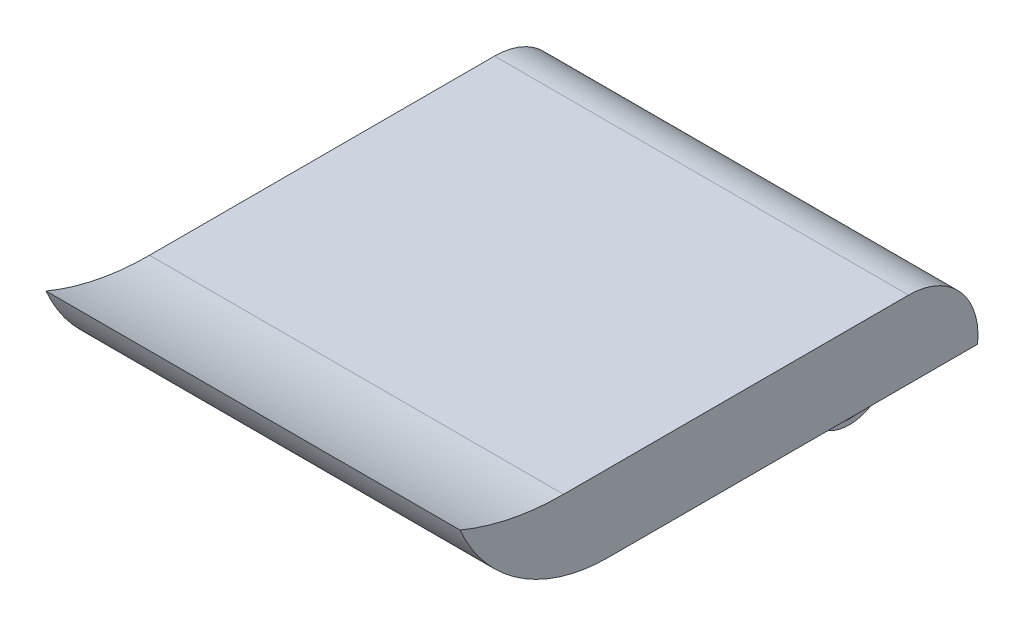
ISO-10303-21;
HEADER;
FILE_DESCRIPTION(('STEP AP214'),'2;1');
FILE_NAME('part.step','',(''),(''),'','','');
FILE_SCHEMA(('AUTOMOTIVE_DESIGN { 1 0 10303 214 1 1 1 1 }'));
ENDSEC;
DATA;
#1=APPLICATION_CONTEXT('core data for automotive mechanical design processes');
#2=APPLICATION_PROTOCOL_DEFINITION('international standard','automotive_design',2000,#1);
#3=PRODUCT_CONTEXT('',#1,'mechanical');
#4=PRODUCT('Part','Part','',(#3));
#5=PRODUCT_RELATED_PRODUCT_CATEGORY('part','',(#4));
#6=PRODUCT_DEFINITION_FORMATION('','',#4);
#7=PRODUCT_DEFINITION_CONTEXT('part definition',#1,'design');
#8=PRODUCT_DEFINITION('design','',#6,#7);
#9=PRODUCT_DEFINITION_SHAPE('','',#8);
#10=(LENGTH_UNIT() NAMED_UNIT(*) SI_UNIT(.MILLI.,.METRE.));
#11=(NAMED_UNIT(*) PLANE_ANGLE_UNIT() SI_UNIT($,.RADIAN.));
#12=(NAMED_UNIT(*) SI_UNIT($,.STERADIAN.) SOLID_ANGLE_UNIT());
#13=UNCERTAINTY_MEASURE_WITH_UNIT(LENGTH_MEASURE(1.E-05),#10,'distance_accuracy_value','');
#14=(GEOMETRIC_REPRESENTATION_CONTEXT(3) GLOBAL_UNCERTAINTY_ASSIGNED_CONTEXT((#13)) GLOBAL_UNIT_ASSIGNED_CONTEXT((#10,
#11,#12)) REPRESENTATION_CONTEXT('',''));
#15=CARTESIAN_POINT('',(0.,0.,0.));
#16=DIRECTION('',(0.,0.,1.));
#17=DIRECTION('',(1.,0.,0.));
#18=AXIS2_PLACEMENT_3D('',#15,#16,#17);
#19=CARTESIAN_POINT('',(10.5,-8.,-11.1941624365482));
#20=DIRECTION('',(-1.,0.,0.));
#21=DIRECTION('',(0.,0.,1.));
#22=AXIS2_PLACEMENT_3D('',#19,#20,#21);
#23=PLANE('',#22);
#24=CARTESIAN_POINT('',(10.5,-5.55,-14.8441624365482));
#25=DIRECTION('',(1.,0.,0.));
#26=DIRECTION('',(0.,0.,-1.));
#27=AXIS2_PLACEMENT_3D('',#24,#25,#26);
#28=CIRCLE('',#27,2.);
#29=CARTESIAN_POINT('',(10.5,-5.55,-16.8441624365482));
#30=VERTEX_POINT('',#29);
#31=EDGE_CURVE('E176',#30,#30,#28,.T.);
#32=ORIENTED_EDGE('',*,*,#31,.F.);
#33=EDGE_LOOP('',(#32));
#34=FACE_BOUND('',#33,.T.);
#35=CARTESIAN_POINT('',(10.5,-4.35,-14.8441624365482));
#36=DIRECTION('',(-1.,0.,0.));
#37=DIRECTION('',(0.,0.,1.));
#38=AXIS2_PLACEMENT_3D('',#35,#36,#37);
#39=CIRCLE('',#38,3.65);
#40=CARTESIAN_POINT('',(10.5,-4.35,-18.4941624365482));
#41=VERTEX_POINT('',#40);
#42=CARTESIAN_POINT('',(10.5,-4.35,-11.1941624365482));
#43=VERTEX_POINT('',#42);
#44=EDGE_CURVE('E167',#41,#43,#39,.T.);
#45=ORIENTED_EDGE('',*,*,#44,.F.);
#46=DIRECTION('',(0.,1.,0.));
#47=VECTOR('',#46,1.);
#48=CARTESIAN_POINT('',(10.5,-8.,-18.4941624365482));
#49=LINE('',#48,#47);
#50=CARTESIAN_POINT('',(10.5,0.,-18.4941624365482));
#51=VERTEX_POINT('',#50);
#52=EDGE_CURVE('E154',#41,#51,#49,.T.);
#53=ORIENTED_EDGE('',*,*,#52,.T.);
#54=DIRECTION('',(0.,0.,1.));
#55=VECTOR('',#54,1.);
#56=CARTESIAN_POINT('',(10.5,0.,-11.1941624365482));
#57=LINE('',#56,#55);
#58=CARTESIAN_POINT('',(10.5,0.,-11.1941624365482));
#59=VERTEX_POINT('',#58);
#60=EDGE_CURVE('E164',#51,#59,#57,.T.);
#61=ORIENTED_EDGE('',*,*,#60,.T.);
#62=DIRECTION('',(0.,1.,0.));
#63=VECTOR('',#62,1.);
#64=CARTESIAN_POINT('',(10.5,-8.,-11.1941624365482));
#65=LINE('',#64,#63);
#66=EDGE_CURVE('E124',#43,#59,#65,.T.);
#67=ORIENTED_EDGE('',*,*,#66,.F.);
#68=EDGE_LOOP('',(#45,#53,#61,#67));
#69=FACE_BOUND('',#68,.T.);
#70=ADVANCED_FACE('F32',(#34,#69),#23,.F.);
#71=CARTESIAN_POINT('',(-10.5,-8.,-11.1941624365482));
#72=DIRECTION('',(1.,0.,0.));
#73=DIRECTION('',(0.,0.,-1.));
#74=AXIS2_PLACEMENT_3D('',#71,#72,#73);
#75=PLANE('',#74);
#76=CARTESIAN_POINT('',(-10.5,-5.55,-14.8441624365482));
#77=DIRECTION('',(1.,0.,0.));
#78=DIRECTION('',(0.,0.,-1.));
#79=AXIS2_PLACEMENT_3D('',#76,#77,#78);
#80=CIRCLE('',#79,2.);
#81=CARTESIAN_POINT('',(-10.5,-5.55,-16.8441624365482));
#82=VERTEX_POINT('',#81);
#83=EDGE_CURVE('E36',#82,#82,#80,.T.);
#84=ORIENTED_EDGE('',*,*,#83,.T.);
#85=EDGE_LOOP('',(#84));
#86=FACE_BOUND('',#85,.T.);
#87=DIRECTION('',(0.,1.,0.));
#88=VECTOR('',#87,1.);
#89=CARTESIAN_POINT('',(-10.5,-8.,-18.4941624365482));
#90=LINE('',#89,#88);
#91=CARTESIAN_POINT('',(-10.5,-4.35,-18.4941624365482));
#92=VERTEX_POINT('',#91);
#93=CARTESIAN_POINT('',(-10.5,0.,-18.4941624365482));
#94=VERTEX_POINT('',#93);
#95=EDGE_CURVE('E47',#92,#94,#90,.T.);
#96=ORIENTED_EDGE('',*,*,#95,.F.);
#97=CARTESIAN_POINT('',(-10.5,-4.35,-14.8441624365482));
#98=DIRECTION('',(-1.,0.,0.));
#99=DIRECTION('',(0.,0.,1.));
#100=AXIS2_PLACEMENT_3D('',#97,#98,#99);
#101=CIRCLE('',#100,3.65);
#102=CARTESIAN_POINT('',(-10.5,-4.35,-11.1941624365482));
#103=VERTEX_POINT('',#102);
#104=EDGE_CURVE('E173',#92,#103,#101,.T.);
#105=ORIENTED_EDGE('',*,*,#104,.T.);
#106=DIRECTION('',(0.,1.,0.));
#107=VECTOR('',#106,1.);
#108=CARTESIAN_POINT('',(-10.5,-8.,-11.1941624365482));
#109=LINE('',#108,#107);
#110=CARTESIAN_POINT('',(-10.5,0.,-11.1941624365482));
#111=VERTEX_POINT('',#110);
#112=EDGE_CURVE('E150',#103,#111,#109,.T.);
#113=ORIENTED_EDGE('',*,*,#112,.T.);
#114=DIRECTION('',(0.,0.,-1.));
#115=VECTOR('',#114,1.);
#116=CARTESIAN_POINT('',(-10.5,0.,-11.1941624365482));
#117=LINE('',#116,#115);
#118=EDGE_CURVE('E159',#111,#94,#117,.T.);
#119=ORIENTED_EDGE('',*,*,#118,.T.);
#120=EDGE_LOOP('',(#96,#105,#113,#119));
#121=FACE_BOUND('',#120,.T.);
#122=ADVANCED_FACE('F183',(#86,#121),#75,.F.);
#123=CARTESIAN_POINT('',(-10.5,-8.,-11.1941624365482));
#124=DIRECTION('',(0.,0.,-1.));
#125=DIRECTION('',(-1.,0.,0.));
#126=AXIS2_PLACEMENT_3D('',#123,#124,#125);
#127=PLANE('',#126);
#128=DIRECTION('',(-1.,0.,0.));
#129=VECTOR('',#128,1.);
#130=CARTESIAN_POINT('',(18.,-4.35,-11.1941624365482));
#131=LINE('',#130,#129);
#132=EDGE_CURVE('E170',#43,#103,#131,.T.);
#133=ORIENTED_EDGE('',*,*,#132,.F.);
#134=ORIENTED_EDGE('',*,*,#66,.T.);
#135=DIRECTION('',(-1.,0.,0.));
#136=VECTOR('',#135,1.);
#137=CARTESIAN_POINT('',(-10.5,0.,-11.1941624365482));
#138=LINE('',#137,#136);
#139=EDGE_CURVE('E161',#59,#111,#138,.T.);
#140=ORIENTED_EDGE('',*,*,#139,.T.);
#141=ORIENTED_EDGE('',*,*,#112,.F.);
#142=EDGE_LOOP('',(#133,#134,#140,#141));
#143=FACE_BOUND('',#142,.T.);
#144=ADVANCED_FACE('F202',(#143),#127,.F.);
#145=CARTESIAN_POINT('',(18.,0.,13.6058375634518));
#146=DIRECTION('',(0.,1.,0.));
#147=DIRECTION('',(0.,0.,1.));
#148=AXIS2_PLACEMENT_3D('',#145,#146,#147);
#149=PLANE('',#148);
#150=ORIENTED_EDGE('',*,*,#60,.F.);
#151=DIRECTION('',(-1.,0.,0.));
#152=VECTOR('',#151,1.);
#153=CARTESIAN_POINT('',(18.,0.,-18.4941624365482));
#154=LINE('',#153,#152);
#155=CARTESIAN_POINT('',(18.,0.,-18.4941624365482));
#156=VERTEX_POINT('',#155);
#157=EDGE_CURVE('E134',#156,#51,#154,.T.);
#158=ORIENTED_EDGE('',*,*,#157,.F.);
#159=DIRECTION('',(0.,0.,-1.));
#160=VECTOR('',#159,1.);
#161=CARTESIAN_POINT('',(18.,0.,13.6058375634518));
#162=LINE('',#161,#160);
#163=CARTESIAN_POINT('',(18.,0.,13.6058375634518));
#164=VERTEX_POINT('',#163);
#165=EDGE_CURVE('E89',#164,#156,#162,.T.);
#166=ORIENTED_EDGE('',*,*,#165,.F.);
#167=DIRECTION('',(-1.,0.,0.));
#168=VECTOR('',#167,1.);
#169=CARTESIAN_POINT('',(18.,0.,13.6058375634518));
#170=LINE('',#169,#168);
#171=CARTESIAN_POINT('',(-18.,0.,13.6058375634518));
#172=VERTEX_POINT('',#171);
#173=EDGE_CURVE('E41',#164,#172,#170,.T.);
#174=ORIENTED_EDGE('',*,*,#173,.T.);
#175=DIRECTION('',(0.,0.,-1.));
#176=VECTOR('',#175,1.);
#177=CARTESIAN_POINT('',(-18.,0.,13.6058375634518));
#178=LINE('',#177,#176);
#179=CARTESIAN_POINT('',(-18.,0.,-18.4941624365482));
#180=VERTEX_POINT('',#179);
#181=EDGE_CURVE('E123',#172,#180,#178,.T.);
#182=ORIENTED_EDGE('',*,*,#181,.T.);
#183=EDGE_CURVE('E111',#94,#180,#154,.T.);
#184=ORIENTED_EDGE('',*,*,#183,.F.);
#185=ORIENTED_EDGE('',*,*,#118,.F.);
#186=ORIENTED_EDGE('',*,*,#139,.F.);
#187=EDGE_LOOP('',(#150,#158,#166,#174,#182,#184,#185,#186));
#188=FACE_BOUND('',#187,.T.);
#189=ADVANCED_FACE('F138',(#188),#149,.F.);
#190=CARTESIAN_POINT('',(18.,14.0323207990599,13.6058375634518));
#191=DIRECTION('',(-1.,0.,0.));
#192=DIRECTION('',(0.,0.,1.));
#193=AXIS2_PLACEMENT_3D('',#190,#191,#192);
#194=CYLINDRICAL_SURFACE('',#193,14.0323207990599);
#195=CARTESIAN_POINT('',(-18.,14.0323207990599,13.6058375634518));
#196=DIRECTION('',(1.,0.,0.));
#197=DIRECTION('',(0.,0.,1.));
#198=AXIS2_PLACEMENT_3D('',#195,#196,#197);
#199=CIRCLE('',#198,14.0323207990599);
#200=CARTESIAN_POINT('',(-18.,8.51,26.5058375634518));
#201=VERTEX_POINT('',#200);
#202=EDGE_CURVE('E120',#201,#172,#199,.T.);
#203=ORIENTED_EDGE('',*,*,#202,.T.);
#204=ORIENTED_EDGE('',*,*,#173,.F.);
#205=CARTESIAN_POINT('',(18.,14.0323207990599,13.6058375634518));
#206=DIRECTION('',(1.,0.,0.));
#207=DIRECTION('',(0.,0.,1.));
#208=AXIS2_PLACEMENT_3D('',#205,#206,#207);
#209=CIRCLE('',#208,14.0323207990599);
#210=CARTESIAN_POINT('',(18.,8.51,26.5058375634518));
#211=VERTEX_POINT('',#210);
#212=EDGE_CURVE('E131',#211,#164,#209,.T.);
#213=ORIENTED_EDGE('',*,*,#212,.F.);
#214=DIRECTION('',(-1.,0.,0.));
#215=VECTOR('',#214,1.);
#216=CARTESIAN_POINT('',(18.,8.51,26.5058375634518));
#217=LINE('',#216,#215);
#218=EDGE_CURVE('E116',#211,#201,#217,.T.);
#219=ORIENTED_EDGE('',*,*,#218,.T.);
#220=EDGE_LOOP('',(#203,#204,#213,#219));
#221=FACE_BOUND('',#220,.T.);
#222=ADVANCED_FACE('F34',(#221),#194,.T.);
#223=CARTESIAN_POINT('',(18.,0.663432835820895,-12.4941624365482));
#224=DIRECTION('',(-1.,0.,0.));
#225=DIRECTION('',(0.,0.,1.));
#226=AXIS2_PLACEMENT_3D('',#223,#224,#225);
#227=CYLINDRICAL_SURFACE('',#226,6.03656716417911);
#228=CARTESIAN_POINT('',(-18.,0.663432835820895,-12.4941624365482));
#229=DIRECTION('',(1.,0.,0.));
#230=DIRECTION('',(0.,0.,1.));
#231=AXIS2_PLACEMENT_3D('',#228,#229,#230);
#232=CIRCLE('',#231,6.03656716417911);
#233=CARTESIAN_POINT('',(-18.,6.7,-12.4941624365482));
#234=VERTEX_POINT('',#233);
#235=EDGE_CURVE('E108',#180,#234,#232,.T.);
#236=ORIENTED_EDGE('',*,*,#235,.T.);
#237=DIRECTION('',(-1.,0.,0.));
#238=VECTOR('',#237,1.);
#239=CARTESIAN_POINT('',(18.,6.7,-12.4941624365482));
#240=LINE('',#239,#238);
#241=CARTESIAN_POINT('',(18.,6.7,-12.4941624365482));
#242=VERTEX_POINT('',#241);
#243=EDGE_CURVE('E105',#242,#234,#240,.T.);
#244=ORIENTED_EDGE('',*,*,#243,.F.);
#245=CARTESIAN_POINT('',(18.,0.663432835820895,-12.4941624365482));
#246=DIRECTION('',(1.,0.,0.));
#247=DIRECTION('',(0.,0.,1.));
#248=AXIS2_PLACEMENT_3D('',#245,#246,#247);
#249=CIRCLE('',#248,6.03656716417911);
#250=EDGE_CURVE('E95',#156,#242,#249,.T.);
#251=ORIENTED_EDGE('',*,*,#250,.F.);
#252=ORIENTED_EDGE('',*,*,#157,.T.);
#253=DIRECTION('',(1.,0.,0.));
#254=VECTOR('',#253,1.);
#255=CARTESIAN_POINT('',(-10.5,0.,-18.4941624365482));
#256=LINE('',#255,#254);
#257=EDGE_CURVE('E157',#94,#51,#256,.T.);
#258=ORIENTED_EDGE('',*,*,#257,.F.);
#259=ORIENTED_EDGE('',*,*,#183,.T.);
#260=EDGE_LOOP('',(#236,#244,#251,#252,#258,#259));
#261=FACE_BOUND('',#260,.T.);
#262=ADVANCED_FACE('F106',(#261),#227,.T.);
#263=CARTESIAN_POINT('',(18.,6.7,17.5058375634518));
#264=DIRECTION('',(0.,-1.,0.));
#265=DIRECTION('',(0.,0.,-1.));
#266=AXIS2_PLACEMENT_3D('',#263,#264,#265);
#267=PLANE('',#266);
#268=DIRECTION('',(0.,0.,1.));
#269=VECTOR('',#268,1.);
#270=CARTESIAN_POINT('',(-18.,6.7,17.5058375634518));
#271=LINE('',#270,#269);
#272=CARTESIAN_POINT('',(-18.,6.7,17.5058375634518));
#273=VERTEX_POINT('',#272);
#274=EDGE_CURVE('E128',#234,#273,#271,.T.);
#275=ORIENTED_EDGE('',*,*,#274,.T.);
#276=DIRECTION('',(-1.,0.,0.));
#277=VECTOR('',#276,1.);
#278=CARTESIAN_POINT('',(18.,6.7,17.5058375634518));
#279=LINE('',#278,#277);
#280=CARTESIAN_POINT('',(18.,6.7,17.5058375634518));
#281=VERTEX_POINT('',#280);
#282=EDGE_CURVE('E112',#281,#273,#279,.T.);
#283=ORIENTED_EDGE('',*,*,#282,.F.);
#284=DIRECTION('',(0.,0.,1.));
#285=VECTOR('',#284,1.);
#286=CARTESIAN_POINT('',(18.,6.7,17.5058375634518));
#287=LINE('',#286,#285);
#288=EDGE_CURVE('E99',#242,#281,#287,.T.);
#289=ORIENTED_EDGE('',*,*,#288,.F.);
#290=ORIENTED_EDGE('',*,*,#243,.T.);
#291=EDGE_LOOP('',(#275,#283,#289,#290));
#292=FACE_BOUND('',#291,.T.);
#293=ADVANCED_FACE('F114',(#292),#267,.F.);
#294=CARTESIAN_POINT('',(18.,29.9806906077348,17.5058375634518));
#295=DIRECTION('',(-1.,0.,0.));
#296=DIRECTION('',(0.,0.,1.));
#297=AXIS2_PLACEMENT_3D('',#294,#295,#296);
#298=CYLINDRICAL_SURFACE('',#297,23.2806906077348);
#299=CARTESIAN_POINT('',(-18.,29.9806906077348,17.5058375634518));
#300=DIRECTION('',(-1.,0.,0.));
#301=DIRECTION('',(0.,0.,1.));
#302=AXIS2_PLACEMENT_3D('',#299,#300,#301);
#303=CIRCLE('',#302,23.2806906077348);
#304=EDGE_CURVE('E80',#273,#201,#303,.T.);
#305=ORIENTED_EDGE('',*,*,#304,.T.);
#306=ORIENTED_EDGE('',*,*,#218,.F.);
#307=CARTESIAN_POINT('',(18.,29.9806906077348,17.5058375634518));
#308=DIRECTION('',(-1.,0.,0.));
#309=DIRECTION('',(0.,0.,1.));
#310=AXIS2_PLACEMENT_3D('',#307,#308,#309);
#311=CIRCLE('',#310,23.2806906077348);
#312=EDGE_CURVE('E56',#281,#211,#311,.T.);
#313=ORIENTED_EDGE('',*,*,#312,.F.);
#314=ORIENTED_EDGE('',*,*,#282,.T.);
#315=EDGE_LOOP('',(#305,#306,#313,#314));
#316=FACE_BOUND('',#315,.T.);
#317=ADVANCED_FACE('F145',(#316),#298,.F.);
#318=CARTESIAN_POINT('',(18.,14.0323207990599,13.6058375634518));
#319=DIRECTION('',(-1.,0.,0.));
#320=DIRECTION('',(0.,0.,1.));
#321=AXIS2_PLACEMENT_3D('',#318,#319,#320);
#322=PLANE('',#321);
#323=ORIENTED_EDGE('',*,*,#212,.T.);
#324=ORIENTED_EDGE('',*,*,#165,.T.);
#325=ORIENTED_EDGE('',*,*,#250,.T.);
#326=ORIENTED_EDGE('',*,*,#288,.T.);
#327=ORIENTED_EDGE('',*,*,#312,.T.);
#328=EDGE_LOOP('',(#323,#324,#325,#326,#327));
#329=FACE_BOUND('',#328,.T.);
#330=ADVANCED_FACE('F97',(#329),#322,.F.);
#331=CARTESIAN_POINT('',(-18.,14.0323207990599,13.6058375634518));
#332=DIRECTION('',(-1.,0.,0.));
#333=DIRECTION('',(0.,0.,1.));
#334=AXIS2_PLACEMENT_3D('',#331,#332,#333);
#335=PLANE('',#334);
#336=ORIENTED_EDGE('',*,*,#202,.F.);
#337=ORIENTED_EDGE('',*,*,#304,.F.);
#338=ORIENTED_EDGE('',*,*,#274,.F.);
#339=ORIENTED_EDGE('',*,*,#235,.F.);
#340=ORIENTED_EDGE('',*,*,#181,.F.);
#341=EDGE_LOOP('',(#336,#337,#338,#339,#340));
#342=FACE_BOUND('',#341,.T.);
#343=ADVANCED_FACE('F144',(#342),#335,.T.);
#344=CARTESIAN_POINT('',(-10.5,-8.,-18.4941624365482));
#345=DIRECTION('',(0.,0.,1.));
#346=DIRECTION('',(1.,0.,0.));
#347=AXIS2_PLACEMENT_3D('',#344,#345,#346);
#348=PLANE('',#347);
#349=ORIENTED_EDGE('',*,*,#52,.F.);
#350=DIRECTION('',(-1.,0.,0.));
#351=VECTOR('',#350,1.);
#352=CARTESIAN_POINT('',(18.,-4.35,-18.4941624365482));
#353=LINE('',#352,#351);
#354=EDGE_CURVE('E11',#41,#92,#353,.T.);
#355=ORIENTED_EDGE('',*,*,#354,.T.);
#356=ORIENTED_EDGE('',*,*,#95,.T.);
#357=ORIENTED_EDGE('',*,*,#257,.T.);
#358=EDGE_LOOP('',(#349,#355,#356,#357));
#359=FACE_BOUND('',#358,.T.);
#360=ADVANCED_FACE('F193',(#359),#348,.F.);
#361=CARTESIAN_POINT('',(18.,-4.35,-14.8441624365482));
#362=DIRECTION('',(-1.,0.,0.));
#363=DIRECTION('',(0.,0.,1.));
#364=AXIS2_PLACEMENT_3D('',#361,#362,#363);
#365=CYLINDRICAL_SURFACE('',#364,3.65);
#366=ORIENTED_EDGE('',*,*,#44,.T.);
#367=ORIENTED_EDGE('',*,*,#132,.T.);
#368=ORIENTED_EDGE('',*,*,#104,.F.);
#369=ORIENTED_EDGE('',*,*,#354,.F.);
#370=EDGE_LOOP('',(#366,#367,#368,#369));
#371=FACE_BOUND('',#370,.T.);
#372=ADVANCED_FACE('F188',(#371),#365,.T.);
#373=CARTESIAN_POINT('',(-18.,-5.55,-14.8441624365482));
#374=DIRECTION('',(1.,0.,0.));
#375=DIRECTION('',(0.,0.,-1.));
#376=AXIS2_PLACEMENT_3D('',#373,#374,#375);
#377=CYLINDRICAL_SURFACE('',#376,2.);
#378=ORIENTED_EDGE('',*,*,#31,.T.);
#379=EDGE_LOOP('',(#378));
#380=FACE_BOUND('',#379,.T.);
#381=ORIENTED_EDGE('',*,*,#83,.F.);
#382=EDGE_LOOP('',(#381));
#383=FACE_BOUND('',#382,.T.);
#384=ADVANCED_FACE('F186',(#380,#383),#377,.F.);
#385=CLOSED_SHELL('',(#70,#122,#144,#189,#222,#262,#293,#317,#330,#343,#360,#372,#384));
#386=MANIFOLD_SOLID_BREP('B2',#385);
#387=ADVANCED_BREP_SHAPE_REPRESENTATION('',(#18,#386),#14);
#388=SHAPE_DEFINITION_REPRESENTATION(#9,#387);
ENDSEC;
END-ISO-10303-21;
